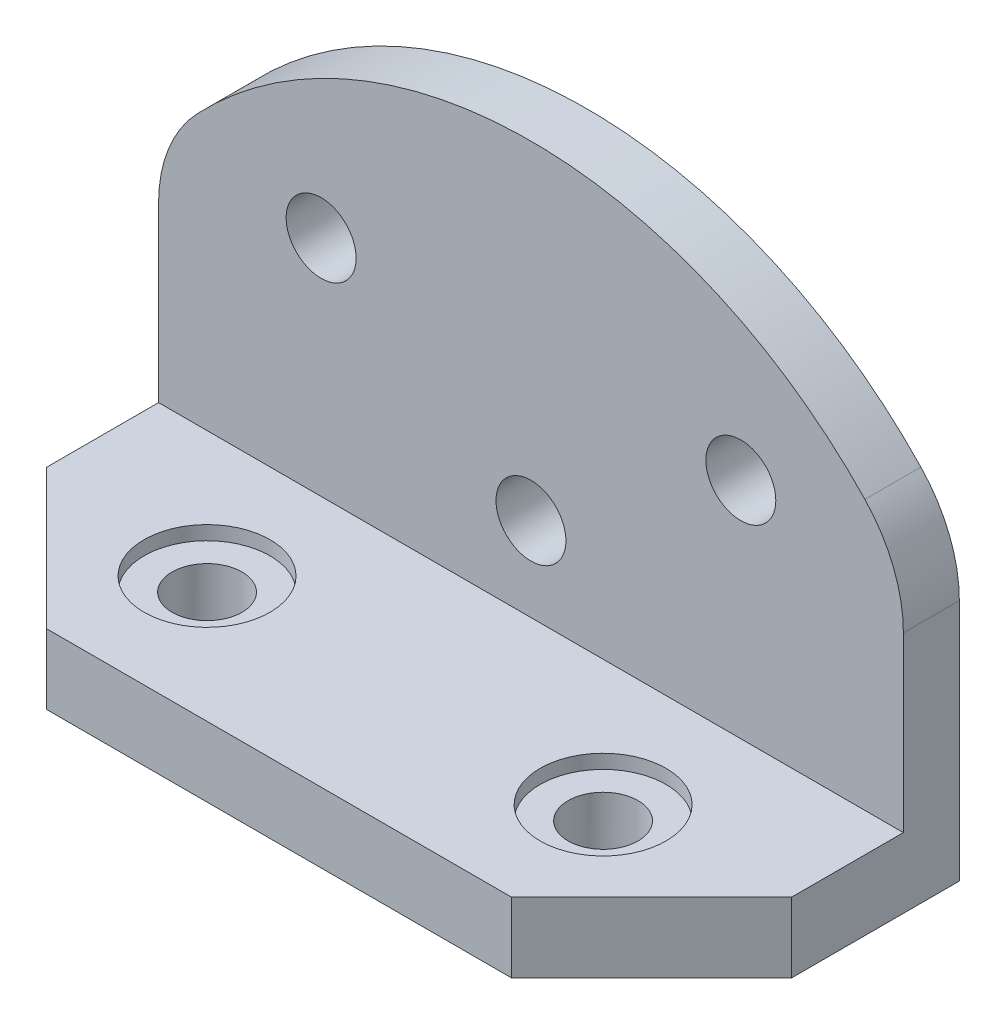
ISO-10303-21;
HEADER;
FILE_DESCRIPTION(('STEP AP214'),'2;1');
FILE_NAME('part.step','',(''),(''),'','','');
FILE_SCHEMA(('AUTOMOTIVE_DESIGN { 1 0 10303 214 1 1 1 1 }'));
ENDSEC;
DATA;
#1=APPLICATION_CONTEXT('core data for automotive mechanical design processes');
#2=APPLICATION_PROTOCOL_DEFINITION('international standard','automotive_design',2000,#1);
#3=PRODUCT_CONTEXT('',#1,'mechanical');
#4=PRODUCT('Part','Part','',(#3));
#5=PRODUCT_RELATED_PRODUCT_CATEGORY('part','',(#4));
#6=PRODUCT_DEFINITION_FORMATION('','',#4);
#7=PRODUCT_DEFINITION_CONTEXT('part definition',#1,'design');
#8=PRODUCT_DEFINITION('design','',#6,#7);
#9=PRODUCT_DEFINITION_SHAPE('','',#8);
#10=(LENGTH_UNIT() NAMED_UNIT(*) SI_UNIT(.MILLI.,.METRE.));
#11=(NAMED_UNIT(*) PLANE_ANGLE_UNIT() SI_UNIT($,.RADIAN.));
#12=(NAMED_UNIT(*) SI_UNIT($,.STERADIAN.) SOLID_ANGLE_UNIT());
#13=UNCERTAINTY_MEASURE_WITH_UNIT(LENGTH_MEASURE(1.E-05),#10,'distance_accuracy_value','');
#14=(GEOMETRIC_REPRESENTATION_CONTEXT(3) GLOBAL_UNCERTAINTY_ASSIGNED_CONTEXT((#13)) GLOBAL_UNIT_ASSIGNED_CONTEXT((#10,
#11,#12)) REPRESENTATION_CONTEXT('',''));
#15=CARTESIAN_POINT('',(0.,0.,0.));
#16=DIRECTION('',(0.,0.,1.));
#17=DIRECTION('',(1.,0.,0.));
#18=AXIS2_PLACEMENT_3D('',#15,#16,#17);
#19=CARTESIAN_POINT('',(7.0774048317708,-6.27479255491148,6.5));
#20=DIRECTION('',(0.,1.,0.));
#21=DIRECTION('',(0.,0.,1.));
#22=AXIS2_PLACEMENT_3D('',#19,#20,#21);
#23=CYLINDRICAL_SURFACE('',#22,1.25);
#24=CARTESIAN_POINT('',(7.0774048317708,0.225207445088519,6.5));
#25=DIRECTION('',(0.,1.,0.));
#26=DIRECTION('',(-1.,0.,0.));
#27=AXIS2_PLACEMENT_3D('',#24,#25,#26);
#28=CIRCLE('',#27,1.25);
#29=CARTESIAN_POINT('',(5.8274048317708,0.225207445088519,6.5));
#30=VERTEX_POINT('',#29);
#31=EDGE_CURVE('E140',#30,#30,#28,.T.);
#32=ORIENTED_EDGE('',*,*,#31,.F.);
#33=EDGE_LOOP('',(#32));
#34=FACE_BOUND('',#33,.T.);
#35=CARTESIAN_POINT('',(7.0774048317708,2.22520744508852,6.5));
#36=DIRECTION('',(0.,1.,0.));
#37=DIRECTION('',(0.,0.,1.));
#38=AXIS2_PLACEMENT_3D('',#35,#36,#37);
#39=CIRCLE('',#38,1.25);
#40=CARTESIAN_POINT('',(7.0774048317708,2.22520744508852,7.75));
#41=VERTEX_POINT('',#40);
#42=EDGE_CURVE('E452',#41,#41,#39,.F.);
#43=ORIENTED_EDGE('',*,*,#42,.F.);
#44=EDGE_LOOP('',(#43));
#45=FACE_BOUND('',#44,.T.);
#46=ADVANCED_FACE('F32',(#34,#45),#23,.F.);
#47=CARTESIAN_POINT('',(-7.0774048317708,-6.27479255491148,6.5));
#48=DIRECTION('',(0.,1.,0.));
#49=DIRECTION('',(0.,0.,1.));
#50=AXIS2_PLACEMENT_3D('',#47,#48,#49);
#51=CYLINDRICAL_SURFACE('',#50,1.25);
#52=CARTESIAN_POINT('',(-7.0774048317708,0.22520744508852,6.5));
#53=DIRECTION('',(0.,1.,0.));
#54=DIRECTION('',(-1.,0.,0.));
#55=AXIS2_PLACEMENT_3D('',#52,#53,#54);
#56=CIRCLE('',#55,1.25);
#57=CARTESIAN_POINT('',(-8.3274048317708,0.22520744508852,6.5));
#58=VERTEX_POINT('',#57);
#59=EDGE_CURVE('E135',#58,#58,#56,.T.);
#60=ORIENTED_EDGE('',*,*,#59,.F.);
#61=EDGE_LOOP('',(#60));
#62=FACE_BOUND('',#61,.T.);
#63=CARTESIAN_POINT('',(-7.0774048317708,2.22520744508852,6.5));
#64=DIRECTION('',(0.,1.,0.));
#65=DIRECTION('',(0.,0.,1.));
#66=AXIS2_PLACEMENT_3D('',#63,#64,#65);
#67=CIRCLE('',#66,1.25);
#68=CARTESIAN_POINT('',(-7.0774048317708,2.22520744508852,7.75));
#69=VERTEX_POINT('',#68);
#70=EDGE_CURVE('E458',#69,#69,#67,.F.);
#71=ORIENTED_EDGE('',*,*,#70,.F.);
#72=EDGE_LOOP('',(#71));
#73=FACE_BOUND('',#72,.T.);
#74=ADVANCED_FACE('F257',(#62,#73),#51,.F.);
#75=CARTESIAN_POINT('',(8.30973577148952,8.90739615578192,2.));
#76=DIRECTION('',(0.,0.,1.));
#77=DIRECTION('',(1.,0.,0.));
#78=AXIS2_PLACEMENT_3D('',#75,#76,#77);
#79=PLANE('',#78);
#80=DIRECTION('',(-1.,0.,0.));
#81=VECTOR('',#80,1.);
#82=CARTESIAN_POINT('',(-13.3097357714895,2.72520744508852,2.));
#83=LINE('',#82,#81);
#84=CARTESIAN_POINT('',(13.3097357714895,2.72520744508852,2.));
#85=VERTEX_POINT('',#84);
#86=CARTESIAN_POINT('',(-13.3097357714895,2.72520744508852,2.));
#87=VERTEX_POINT('',#86);
#88=EDGE_CURVE('E125',#85,#87,#83,.T.);
#89=ORIENTED_EDGE('',*,*,#88,.F.);
#90=DIRECTION('',(0.,1.,0.));
#91=VECTOR('',#90,1.);
#92=CARTESIAN_POINT('',(13.3097357714895,0.225207445088519,2.));
#93=LINE('',#92,#91);
#94=CARTESIAN_POINT('',(13.3097357714895,8.90739615578192,2.));
#95=VERTEX_POINT('',#94);
#96=EDGE_CURVE('E174',#85,#95,#93,.T.);
#97=ORIENTED_EDGE('',*,*,#96,.T.);
#98=CARTESIAN_POINT('',(8.30973577148952,8.90739615578192,2.));
#99=DIRECTION('',(0.,0.,1.));
#100=DIRECTION('',(1.,0.,0.));
#101=AXIS2_PLACEMENT_3D('',#98,#99,#100);
#102=CIRCLE('',#101,5.);
#103=CARTESIAN_POINT('',(11.9349756409376,12.3508879720875,2.));
#104=VERTEX_POINT('',#103);
#105=EDGE_CURVE('E172',#95,#104,#102,.T.);
#106=ORIENTED_EDGE('',*,*,#105,.T.);
#107=CARTESIAN_POINT('',(0.,1.01426131360597,2.));
#108=DIRECTION('',(0.,0.,1.));
#109=DIRECTION('',(1.,0.,0.));
#110=AXIS2_PLACEMENT_3D('',#107,#108,#109);
#111=CIRCLE('',#110,16.4609461314825);
#112=CARTESIAN_POINT('',(-11.9349756409376,12.3508879720875,2.));
#113=VERTEX_POINT('',#112);
#114=EDGE_CURVE('E206',#104,#113,#111,.T.);
#115=ORIENTED_EDGE('',*,*,#114,.T.);
#116=CARTESIAN_POINT('',(-8.30973577148952,8.90739615578192,2.));
#117=DIRECTION('',(0.,0.,1.));
#118=DIRECTION('',(1.,0.,0.));
#119=AXIS2_PLACEMENT_3D('',#116,#117,#118);
#120=CIRCLE('',#119,5.);
#121=CARTESIAN_POINT('',(-13.3097357714895,8.90739615578192,2.));
#122=VERTEX_POINT('',#121);
#123=EDGE_CURVE('E128',#113,#122,#120,.T.);
#124=ORIENTED_EDGE('',*,*,#123,.T.);
#125=DIRECTION('',(0.,-1.,0.));
#126=VECTOR('',#125,1.);
#127=CARTESIAN_POINT('',(-13.3097357714895,8.90739615578192,2.));
#128=LINE('',#127,#126);
#129=EDGE_CURVE('E113',#122,#87,#128,.T.);
#130=ORIENTED_EDGE('',*,*,#129,.T.);
#131=EDGE_LOOP('',(#89,#97,#106,#115,#124,#130));
#132=FACE_BOUND('',#131,.T.);
#133=CARTESIAN_POINT('',(-7.50026422851047,10.7252074450885,2.));
#134=DIRECTION('',(0.,0.,1.));
#135=DIRECTION('',(1.,0.,0.));
#136=AXIS2_PLACEMENT_3D('',#133,#134,#135);
#137=CIRCLE('',#136,1.25);
#138=CARTESIAN_POINT('',(-6.25026422851047,10.7252074450885,2.));
#139=VERTEX_POINT('',#138);
#140=EDGE_CURVE('E158',#139,#139,#137,.T.);
#141=ORIENTED_EDGE('',*,*,#140,.F.);
#142=EDGE_LOOP('',(#141));
#143=FACE_BOUND('',#142,.T.);
#144=CARTESIAN_POINT('',(7.49973577148953,10.7252074450885,2.));
#145=DIRECTION('',(0.,0.,1.));
#146=DIRECTION('',(1.,0.,0.));
#147=AXIS2_PLACEMENT_3D('',#144,#145,#146);
#148=CIRCLE('',#147,1.25);
#149=CARTESIAN_POINT('',(8.74973577148952,10.7252074450885,2.));
#150=VERTEX_POINT('',#149);
#151=EDGE_CURVE('E164',#150,#150,#148,.T.);
#152=ORIENTED_EDGE('',*,*,#151,.F.);
#153=EDGE_LOOP('',(#152));
#154=FACE_BOUND('',#153,.T.);
#155=CARTESIAN_POINT('',(-0.000264228510474251,5.72520744508852,2.));
#156=DIRECTION('',(0.,0.,1.));
#157=DIRECTION('',(1.,0.,0.));
#158=AXIS2_PLACEMENT_3D('',#155,#156,#157);
#159=CIRCLE('',#158,1.25);
#160=CARTESIAN_POINT('',(1.24973577148953,5.72520744508852,2.));
#161=VERTEX_POINT('',#160);
#162=EDGE_CURVE('E151',#161,#161,#159,.T.);
#163=ORIENTED_EDGE('',*,*,#162,.F.);
#164=EDGE_LOOP('',(#163));
#165=FACE_BOUND('',#164,.T.);
#166=ADVANCED_FACE('F123',(#132,#143,#154,#165),#79,.T.);
#167=CARTESIAN_POINT('',(8.30973577148952,8.90739615578192,0.));
#168=DIRECTION('',(0.,0.,1.));
#169=DIRECTION('',(1.,0.,0.));
#170=AXIS2_PLACEMENT_3D('',#167,#168,#169);
#171=PLANE('',#170);
#172=DIRECTION('',(0.,1.,0.));
#173=VECTOR('',#172,1.);
#174=CARTESIAN_POINT('',(13.3097357714895,0.225207445088519,0.));
#175=LINE('',#174,#173);
#176=CARTESIAN_POINT('',(13.3097357714895,0.225207445088519,0.));
#177=VERTEX_POINT('',#176);
#178=CARTESIAN_POINT('',(13.3097357714895,8.90739615578192,0.));
#179=VERTEX_POINT('',#178);
#180=EDGE_CURVE('E167',#177,#179,#175,.T.);
#181=ORIENTED_EDGE('',*,*,#180,.F.);
#182=DIRECTION('',(1.,0.,0.));
#183=VECTOR('',#182,1.);
#184=CARTESIAN_POINT('',(-13.3097357714895,0.22520744508852,0.));
#185=LINE('',#184,#183);
#186=CARTESIAN_POINT('',(-13.3097357714895,0.22520744508852,0.));
#187=VERTEX_POINT('',#186);
#188=EDGE_CURVE('E176',#187,#177,#185,.T.);
#189=ORIENTED_EDGE('',*,*,#188,.F.);
#190=DIRECTION('',(0.,-1.,0.));
#191=VECTOR('',#190,1.);
#192=CARTESIAN_POINT('',(-13.3097357714895,8.90739615578192,0.));
#193=LINE('',#192,#191);
#194=CARTESIAN_POINT('',(-13.3097357714895,8.90739615578192,0.));
#195=VERTEX_POINT('',#194);
#196=EDGE_CURVE('E194',#195,#187,#193,.T.);
#197=ORIENTED_EDGE('',*,*,#196,.F.);
#198=CARTESIAN_POINT('',(-8.30973577148952,8.90739615578192,0.));
#199=DIRECTION('',(0.,0.,1.));
#200=DIRECTION('',(1.,0.,0.));
#201=AXIS2_PLACEMENT_3D('',#198,#199,#200);
#202=CIRCLE('',#201,5.);
#203=CARTESIAN_POINT('',(-11.9349756409376,12.3508879720875,0.));
#204=VERTEX_POINT('',#203);
#205=EDGE_CURVE('E197',#204,#195,#202,.T.);
#206=ORIENTED_EDGE('',*,*,#205,.F.);
#207=CARTESIAN_POINT('',(0.,1.01426131360597,0.));
#208=DIRECTION('',(0.,0.,1.));
#209=DIRECTION('',(1.,0.,0.));
#210=AXIS2_PLACEMENT_3D('',#207,#208,#209);
#211=CIRCLE('',#210,16.4609461314825);
#212=CARTESIAN_POINT('',(11.9349756409376,12.3508879720875,0.));
#213=VERTEX_POINT('',#212);
#214=EDGE_CURVE('E199',#213,#204,#211,.T.);
#215=ORIENTED_EDGE('',*,*,#214,.F.);
#216=CARTESIAN_POINT('',(8.30973577148952,8.90739615578192,0.));
#217=DIRECTION('',(0.,0.,1.));
#218=DIRECTION('',(1.,0.,0.));
#219=AXIS2_PLACEMENT_3D('',#216,#217,#218);
#220=CIRCLE('',#219,5.);
#221=EDGE_CURVE('E201',#179,#213,#220,.T.);
#222=ORIENTED_EDGE('',*,*,#221,.F.);
#223=EDGE_LOOP('',(#181,#189,#197,#206,#215,#222));
#224=FACE_BOUND('',#223,.T.);
#225=CARTESIAN_POINT('',(7.49973577148953,10.7252074450885,0.));
#226=DIRECTION('',(0.,0.,1.));
#227=DIRECTION('',(1.,0.,0.));
#228=AXIS2_PLACEMENT_3D('',#225,#226,#227);
#229=CIRCLE('',#228,1.25);
#230=CARTESIAN_POINT('',(8.74973577148952,10.7252074450885,0.));
#231=VERTEX_POINT('',#230);
#232=EDGE_CURVE('E161',#231,#231,#229,.T.);
#233=ORIENTED_EDGE('',*,*,#232,.T.);
#234=EDGE_LOOP('',(#233));
#235=FACE_BOUND('',#234,.T.);
#236=CARTESIAN_POINT('',(-7.50026422851047,10.7252074450885,0.));
#237=DIRECTION('',(0.,0.,1.));
#238=DIRECTION('',(1.,0.,0.));
#239=AXIS2_PLACEMENT_3D('',#236,#237,#238);
#240=CIRCLE('',#239,1.25);
#241=CARTESIAN_POINT('',(-6.25026422851047,10.7252074450885,0.));
#242=VERTEX_POINT('',#241);
#243=EDGE_CURVE('E154',#242,#242,#240,.T.);
#244=ORIENTED_EDGE('',*,*,#243,.T.);
#245=EDGE_LOOP('',(#244));
#246=FACE_BOUND('',#245,.T.);
#247=CARTESIAN_POINT('',(-0.000264228510474251,5.72520744508852,0.));
#248=DIRECTION('',(0.,0.,1.));
#249=DIRECTION('',(1.,0.,0.));
#250=AXIS2_PLACEMENT_3D('',#247,#248,#249);
#251=CIRCLE('',#250,1.25);
#252=CARTESIAN_POINT('',(1.24973577148953,5.72520744508852,0.));
#253=VERTEX_POINT('',#252);
#254=EDGE_CURVE('E155',#253,#253,#251,.T.);
#255=ORIENTED_EDGE('',*,*,#254,.T.);
#256=EDGE_LOOP('',(#255));
#257=FACE_BOUND('',#256,.T.);
#258=ADVANCED_FACE('F224',(#224,#235,#246,#257),#171,.F.);
#259=CARTESIAN_POINT('',(13.3097357714895,0.225207445088519,2.));
#260=DIRECTION('',(-1.,0.,0.));
#261=DIRECTION('',(0.,0.,1.));
#262=AXIS2_PLACEMENT_3D('',#259,#260,#261);
#263=PLANE('',#262);
#264=DIRECTION('',(0.,0.,-1.));
#265=VECTOR('',#264,1.);
#266=CARTESIAN_POINT('',(13.3097357714895,2.72520744508852,11.));
#267=LINE('',#266,#265);
#268=CARTESIAN_POINT('',(13.3097357714895,2.72520744508852,5.99999999999998));
#269=VERTEX_POINT('',#268);
#270=EDGE_CURVE('E118',#269,#85,#267,.T.);
#271=ORIENTED_EDGE('',*,*,#270,.F.);
#272=DIRECTION('',(0.,-1.,0.));
#273=VECTOR('',#272,1.);
#274=CARTESIAN_POINT('',(13.3097357714895,0.225207445088519,5.99999999999998));
#275=LINE('',#274,#273);
#276=CARTESIAN_POINT('',(13.3097357714895,0.225207445088519,5.99999999999998));
#277=VERTEX_POINT('',#276);
#278=EDGE_CURVE('E55',#269,#277,#275,.T.);
#279=ORIENTED_EDGE('',*,*,#278,.T.);
#280=DIRECTION('',(0.,0.,-1.));
#281=VECTOR('',#280,1.);
#282=CARTESIAN_POINT('',(13.3097357714895,0.225207445088519,2.));
#283=LINE('',#282,#281);
#284=EDGE_CURVE('E130',#277,#177,#283,.T.);
#285=ORIENTED_EDGE('',*,*,#284,.T.);
#286=ORIENTED_EDGE('',*,*,#180,.T.);
#287=DIRECTION('',(0.,0.,-1.));
#288=VECTOR('',#287,1.);
#289=CARTESIAN_POINT('',(13.3097357714895,8.90739615578192,2.));
#290=LINE('',#289,#288);
#291=EDGE_CURVE('E177',#95,#179,#290,.T.);
#292=ORIENTED_EDGE('',*,*,#291,.F.);
#293=ORIENTED_EDGE('',*,*,#96,.F.);
#294=EDGE_LOOP('',(#271,#279,#285,#286,#292,#293));
#295=FACE_BOUND('',#294,.T.);
#296=ADVANCED_FACE('F247',(#295),#263,.F.);
#297=CARTESIAN_POINT('',(8.30973577148952,8.90739615578192,2.));
#298=DIRECTION('',(0.,0.,-1.));
#299=DIRECTION('',(-1.,0.,0.));
#300=AXIS2_PLACEMENT_3D('',#297,#298,#299);
#301=CYLINDRICAL_SURFACE('',#300,5.);
#302=ORIENTED_EDGE('',*,*,#221,.T.);
#303=DIRECTION('',(0.,0.,-1.));
#304=VECTOR('',#303,1.);
#305=CARTESIAN_POINT('',(11.9349756409376,12.3508879720875,2.));
#306=LINE('',#305,#304);
#307=EDGE_CURVE('E181',#104,#213,#306,.T.);
#308=ORIENTED_EDGE('',*,*,#307,.F.);
#309=ORIENTED_EDGE('',*,*,#105,.F.);
#310=ORIENTED_EDGE('',*,*,#291,.T.);
#311=EDGE_LOOP('',(#302,#308,#309,#310));
#312=FACE_BOUND('',#311,.T.);
#313=ADVANCED_FACE('F213',(#312),#301,.T.);
#314=CARTESIAN_POINT('',(0.,1.01426131360597,2.));
#315=DIRECTION('',(0.,0.,-1.));
#316=DIRECTION('',(-1.,0.,0.));
#317=AXIS2_PLACEMENT_3D('',#314,#315,#316);
#318=CYLINDRICAL_SURFACE('',#317,16.4609461314825);
#319=ORIENTED_EDGE('',*,*,#214,.T.);
#320=DIRECTION('',(0.,0.,-1.));
#321=VECTOR('',#320,1.);
#322=CARTESIAN_POINT('',(-11.9349756409376,12.3508879720875,2.));
#323=LINE('',#322,#321);
#324=EDGE_CURVE('E184',#113,#204,#323,.T.);
#325=ORIENTED_EDGE('',*,*,#324,.F.);
#326=ORIENTED_EDGE('',*,*,#114,.F.);
#327=ORIENTED_EDGE('',*,*,#307,.T.);
#328=EDGE_LOOP('',(#319,#325,#326,#327));
#329=FACE_BOUND('',#328,.T.);
#330=ADVANCED_FACE('F216',(#329),#318,.T.);
#331=CARTESIAN_POINT('',(-8.30973577148952,8.90739615578192,2.));
#332=DIRECTION('',(0.,0.,-1.));
#333=DIRECTION('',(-1.,0.,0.));
#334=AXIS2_PLACEMENT_3D('',#331,#332,#333);
#335=CYLINDRICAL_SURFACE('',#334,5.);
#336=ORIENTED_EDGE('',*,*,#205,.T.);
#337=DIRECTION('',(0.,0.,-1.));
#338=VECTOR('',#337,1.);
#339=CARTESIAN_POINT('',(-13.3097357714895,8.90739615578192,2.));
#340=LINE('',#339,#338);
#341=EDGE_CURVE('E187',#122,#195,#340,.T.);
#342=ORIENTED_EDGE('',*,*,#341,.F.);
#343=ORIENTED_EDGE('',*,*,#123,.F.);
#344=ORIENTED_EDGE('',*,*,#324,.T.);
#345=EDGE_LOOP('',(#336,#342,#343,#344));
#346=FACE_BOUND('',#345,.T.);
#347=ADVANCED_FACE('F219',(#346),#335,.T.);
#348=CARTESIAN_POINT('',(-13.3097357714895,8.90739615578192,2.));
#349=DIRECTION('',(1.,0.,0.));
#350=DIRECTION('',(0.,0.,-1.));
#351=AXIS2_PLACEMENT_3D('',#348,#349,#350);
#352=PLANE('',#351);
#353=DIRECTION('',(0.,0.,-1.));
#354=VECTOR('',#353,1.);
#355=CARTESIAN_POINT('',(-13.3097357714895,0.22520744508852,2.));
#356=LINE('',#355,#354);
#357=CARTESIAN_POINT('',(-13.3097357714895,0.22520744508852,5.99999999999998));
#358=VERTEX_POINT('',#357);
#359=EDGE_CURVE('E189',#358,#187,#356,.T.);
#360=ORIENTED_EDGE('',*,*,#359,.F.);
#361=DIRECTION('',(0.,1.,0.));
#362=VECTOR('',#361,1.);
#363=CARTESIAN_POINT('',(-13.3097357714895,8.90739615578192,5.99999999999998));
#364=LINE('',#363,#362);
#365=CARTESIAN_POINT('',(-13.3097357714895,2.72520744508852,5.99999999999998));
#366=VERTEX_POINT('',#365);
#367=EDGE_CURVE('E11',#358,#366,#364,.T.);
#368=ORIENTED_EDGE('',*,*,#367,.T.);
#369=DIRECTION('',(0.,0.,-1.));
#370=VECTOR('',#369,1.);
#371=CARTESIAN_POINT('',(-13.3097357714895,2.72520744508852,11.));
#372=LINE('',#371,#370);
#373=EDGE_CURVE('E109',#366,#87,#372,.T.);
#374=ORIENTED_EDGE('',*,*,#373,.T.);
#375=ORIENTED_EDGE('',*,*,#129,.F.);
#376=ORIENTED_EDGE('',*,*,#341,.T.);
#377=ORIENTED_EDGE('',*,*,#196,.T.);
#378=EDGE_LOOP('',(#360,#368,#374,#375,#376,#377));
#379=FACE_BOUND('',#378,.T.);
#380=ADVANCED_FACE('F111',(#379),#352,.F.);
#381=CARTESIAN_POINT('',(-13.3097357714895,0.22520744508852,2.));
#382=DIRECTION('',(0.,1.,0.));
#383=DIRECTION('',(-1.,0.,0.));
#384=AXIS2_PLACEMENT_3D('',#381,#382,#383);
#385=PLANE('',#384);
#386=ORIENTED_EDGE('',*,*,#31,.T.);
#387=EDGE_LOOP('',(#386));
#388=FACE_BOUND('',#387,.T.);
#389=ORIENTED_EDGE('',*,*,#59,.T.);
#390=EDGE_LOOP('',(#389));
#391=FACE_BOUND('',#390,.T.);
#392=ORIENTED_EDGE('',*,*,#284,.F.);
#393=DIRECTION('',(0.707106781186546,0.,-0.707106781186549));
#394=VECTOR('',#393,1.);
#395=CARTESIAN_POINT('',(8.30973577148952,0.225207445088519,11.));
#396=LINE('',#395,#394);
#397=CARTESIAN_POINT('',(8.30973577148952,0.225207445088519,11.));
#398=VERTEX_POINT('',#397);
#399=EDGE_CURVE('E40',#277,#398,#396,.F.);
#400=ORIENTED_EDGE('',*,*,#399,.T.);
#401=DIRECTION('',(1.,0.,0.));
#402=VECTOR('',#401,1.);
#403=CARTESIAN_POINT('',(-13.3097357714895,0.22520744508852,11.));
#404=LINE('',#403,#402);
#405=CARTESIAN_POINT('',(-8.30973577148953,0.22520744508852,11.));
#406=VERTEX_POINT('',#405);
#407=EDGE_CURVE('E134',#406,#398,#404,.T.);
#408=ORIENTED_EDGE('',*,*,#407,.F.);
#409=DIRECTION('',(0.707106781186546,0.,0.707106781186549));
#410=VECTOR('',#409,1.);
#411=CARTESIAN_POINT('',(-8.30973577148952,0.22520744508852,11.));
#412=LINE('',#411,#410);
#413=EDGE_CURVE('E47',#406,#358,#412,.F.);
#414=ORIENTED_EDGE('',*,*,#413,.T.);
#415=ORIENTED_EDGE('',*,*,#359,.T.);
#416=ORIENTED_EDGE('',*,*,#188,.T.);
#417=EDGE_LOOP('',(#392,#400,#408,#414,#415,#416));
#418=FACE_BOUND('',#417,.T.);
#419=ADVANCED_FACE('F226',(#388,#391,#418),#385,.F.);
#420=CARTESIAN_POINT('',(7.49973577148953,10.7252074450885,2.));
#421=DIRECTION('',(0.,0.,-1.));
#422=DIRECTION('',(-1.,0.,0.));
#423=AXIS2_PLACEMENT_3D('',#420,#421,#422);
#424=CYLINDRICAL_SURFACE('',#423,1.25);
#425=ORIENTED_EDGE('',*,*,#151,.T.);
#426=EDGE_LOOP('',(#425));
#427=FACE_BOUND('',#426,.T.);
#428=ORIENTED_EDGE('',*,*,#232,.F.);
#429=EDGE_LOOP('',(#428));
#430=FACE_BOUND('',#429,.T.);
#431=ADVANCED_FACE('F284',(#427,#430),#424,.F.);
#432=CARTESIAN_POINT('',(-7.50026422851047,10.7252074450885,2.));
#433=DIRECTION('',(0.,0.,-1.));
#434=DIRECTION('',(-1.,0.,0.));
#435=AXIS2_PLACEMENT_3D('',#432,#433,#434);
#436=CYLINDRICAL_SURFACE('',#435,1.25);
#437=ORIENTED_EDGE('',*,*,#140,.T.);
#438=EDGE_LOOP('',(#437));
#439=FACE_BOUND('',#438,.T.);
#440=ORIENTED_EDGE('',*,*,#243,.F.);
#441=EDGE_LOOP('',(#440));
#442=FACE_BOUND('',#441,.T.);
#443=ADVANCED_FACE('F280',(#439,#442),#436,.F.);
#444=CARTESIAN_POINT('',(-0.000264228510474251,5.72520744508852,2.));
#445=DIRECTION('',(0.,0.,-1.));
#446=DIRECTION('',(-1.,0.,0.));
#447=AXIS2_PLACEMENT_3D('',#444,#445,#446);
#448=CYLINDRICAL_SURFACE('',#447,1.25);
#449=ORIENTED_EDGE('',*,*,#162,.T.);
#450=EDGE_LOOP('',(#449));
#451=FACE_BOUND('',#450,.T.);
#452=ORIENTED_EDGE('',*,*,#254,.F.);
#453=EDGE_LOOP('',(#452));
#454=FACE_BOUND('',#453,.T.);
#455=ADVANCED_FACE('F276',(#451,#454),#448,.F.);
#456=CARTESIAN_POINT('',(-13.3097357714895,2.72520744508852,11.));
#457=DIRECTION('',(0.,-1.,0.));
#458=DIRECTION('',(0.,0.,-1.));
#459=AXIS2_PLACEMENT_3D('',#456,#457,#458);
#460=PLANE('',#459);
#461=CARTESIAN_POINT('',(7.0774048317708,2.72520744508852,6.5));
#462=DIRECTION('',(0.,1.,0.));
#463=DIRECTION('',(0.,0.,1.));
#464=AXIS2_PLACEMENT_3D('',#461,#462,#463);
#465=CIRCLE('',#464,2.25);
#466=CARTESIAN_POINT('',(7.0774048317708,2.72520744508852,8.75));
#467=VERTEX_POINT('',#466);
#468=EDGE_CURVE('E450',#467,#467,#465,.T.);
#469=ORIENTED_EDGE('',*,*,#468,.F.);
#470=EDGE_LOOP('',(#469));
#471=FACE_BOUND('',#470,.T.);
#472=CARTESIAN_POINT('',(-7.0774048317708,2.72520744508852,6.5));
#473=DIRECTION('',(0.,1.,0.));
#474=DIRECTION('',(0.,0.,1.));
#475=AXIS2_PLACEMENT_3D('',#472,#473,#474);
#476=CIRCLE('',#475,2.25);
#477=CARTESIAN_POINT('',(-7.0774048317708,2.72520744508852,8.75));
#478=VERTEX_POINT('',#477);
#479=EDGE_CURVE('E459',#478,#478,#476,.T.);
#480=ORIENTED_EDGE('',*,*,#479,.F.);
#481=EDGE_LOOP('',(#480));
#482=FACE_BOUND('',#481,.T.);
#483=DIRECTION('',(-1.,0.,0.));
#484=VECTOR('',#483,1.);
#485=CARTESIAN_POINT('',(-13.3097357714895,2.72520744508852,11.));
#486=LINE('',#485,#484);
#487=CARTESIAN_POINT('',(8.30973577148952,2.72520744508852,11.));
#488=VERTEX_POINT('',#487);
#489=CARTESIAN_POINT('',(-8.30973577148953,2.72520744508852,11.));
#490=VERTEX_POINT('',#489);
#491=EDGE_CURVE('E119',#488,#490,#486,.T.);
#492=ORIENTED_EDGE('',*,*,#491,.F.);
#493=DIRECTION('',(-0.707106781186546,0.,0.707106781186549));
#494=VECTOR('',#493,1.);
#495=CARTESIAN_POINT('',(8.30973577148952,2.72520744508852,11.));
#496=LINE('',#495,#494);
#497=EDGE_CURVE('E233',#488,#269,#496,.F.);
#498=ORIENTED_EDGE('',*,*,#497,.T.);
#499=ORIENTED_EDGE('',*,*,#270,.T.);
#500=ORIENTED_EDGE('',*,*,#88,.T.);
#501=ORIENTED_EDGE('',*,*,#373,.F.);
#502=DIRECTION('',(-0.707106781186546,0.,-0.707106781186549));
#503=VECTOR('',#502,1.);
#504=CARTESIAN_POINT('',(-8.30973577148952,2.72520744508852,11.));
#505=LINE('',#504,#503);
#506=EDGE_CURVE('E231',#366,#490,#505,.F.);
#507=ORIENTED_EDGE('',*,*,#506,.T.);
#508=EDGE_LOOP('',(#492,#498,#499,#500,#501,#507));
#509=FACE_BOUND('',#508,.T.);
#510=ADVANCED_FACE('F133',(#471,#482,#509),#460,.F.);
#511=CARTESIAN_POINT('',(0.,0.,11.));
#512=DIRECTION('',(0.,0.,-1.));
#513=DIRECTION('',(-1.,0.,0.));
#514=AXIS2_PLACEMENT_3D('',#511,#512,#513);
#515=PLANE('',#514);
#516=ORIENTED_EDGE('',*,*,#407,.T.);
#517=DIRECTION('',(0.,1.,0.));
#518=VECTOR('',#517,1.);
#519=CARTESIAN_POINT('',(8.30973577148952,0.,11.));
#520=LINE('',#519,#518);
#521=EDGE_CURVE('E234',#398,#488,#520,.T.);
#522=ORIENTED_EDGE('',*,*,#521,.T.);
#523=ORIENTED_EDGE('',*,*,#491,.T.);
#524=DIRECTION('',(0.,-1.,0.));
#525=VECTOR('',#524,1.);
#526=CARTESIAN_POINT('',(-8.30973577148952,0.,11.));
#527=LINE('',#526,#525);
#528=EDGE_CURVE('E180',#490,#406,#527,.T.);
#529=ORIENTED_EDGE('',*,*,#528,.T.);
#530=EDGE_LOOP('',(#516,#522,#523,#529));
#531=FACE_BOUND('',#530,.T.);
#532=ADVANCED_FACE('F245',(#531),#515,.F.);
#533=CARTESIAN_POINT('',(-7.0774048317708,2.22520744508852,6.5));
#534=DIRECTION('',(0.,1.,0.));
#535=DIRECTION('',(0.,0.,1.));
#536=AXIS2_PLACEMENT_3D('',#533,#534,#535);
#537=PLANE('',#536);
#538=CARTESIAN_POINT('',(-7.0774048317708,2.22520744508852,6.5));
#539=DIRECTION('',(0.,1.,0.));
#540=DIRECTION('',(0.,0.,1.));
#541=AXIS2_PLACEMENT_3D('',#538,#539,#540);
#542=CIRCLE('',#541,2.25);
#543=CARTESIAN_POINT('',(-7.0774048317708,2.22520744508852,8.75));
#544=VERTEX_POINT('',#543);
#545=EDGE_CURVE('E455',#544,#544,#542,.T.);
#546=ORIENTED_EDGE('',*,*,#545,.T.);
#547=EDGE_LOOP('',(#546));
#548=FACE_BOUND('',#547,.T.);
#549=ORIENTED_EDGE('',*,*,#70,.T.);
#550=EDGE_LOOP('',(#549));
#551=FACE_BOUND('',#550,.T.);
#552=ADVANCED_FACE('F273',(#548,#551),#537,.T.);
#553=CARTESIAN_POINT('',(-7.0774048317708,2.22520744508852,6.5));
#554=DIRECTION('',(0.,1.,0.));
#555=DIRECTION('',(0.,0.,1.));
#556=AXIS2_PLACEMENT_3D('',#553,#554,#555);
#557=CYLINDRICAL_SURFACE('',#556,2.25);
#558=ORIENTED_EDGE('',*,*,#545,.F.);
#559=EDGE_LOOP('',(#558));
#560=FACE_BOUND('',#559,.T.);
#561=ORIENTED_EDGE('',*,*,#479,.T.);
#562=EDGE_LOOP('',(#561));
#563=FACE_BOUND('',#562,.T.);
#564=ADVANCED_FACE('F268',(#560,#563),#557,.F.);
#565=CARTESIAN_POINT('',(7.0774048317708,2.22520744508852,6.5));
#566=DIRECTION('',(0.,1.,0.));
#567=DIRECTION('',(0.,0.,1.));
#568=AXIS2_PLACEMENT_3D('',#565,#566,#567);
#569=PLANE('',#568);
#570=CARTESIAN_POINT('',(7.0774048317708,2.22520744508852,6.5));
#571=DIRECTION('',(0.,1.,0.));
#572=DIRECTION('',(0.,0.,1.));
#573=AXIS2_PLACEMENT_3D('',#570,#571,#572);
#574=CIRCLE('',#573,2.25);
#575=CARTESIAN_POINT('',(7.0774048317708,2.22520744508852,8.75));
#576=VERTEX_POINT('',#575);
#577=EDGE_CURVE('E447',#576,#576,#574,.T.);
#578=ORIENTED_EDGE('',*,*,#577,.T.);
#579=EDGE_LOOP('',(#578));
#580=FACE_BOUND('',#579,.T.);
#581=ORIENTED_EDGE('',*,*,#42,.T.);
#582=EDGE_LOOP('',(#581));
#583=FACE_BOUND('',#582,.T.);
#584=ADVANCED_FACE('F350',(#580,#583),#569,.T.);
#585=CARTESIAN_POINT('',(7.0774048317708,2.22520744508852,6.5));
#586=DIRECTION('',(0.,1.,0.));
#587=DIRECTION('',(0.,0.,1.));
#588=AXIS2_PLACEMENT_3D('',#585,#586,#587);
#589=CYLINDRICAL_SURFACE('',#588,2.25);
#590=ORIENTED_EDGE('',*,*,#577,.F.);
#591=EDGE_LOOP('',(#590));
#592=FACE_BOUND('',#591,.T.);
#593=ORIENTED_EDGE('',*,*,#468,.T.);
#594=EDGE_LOOP('',(#593));
#595=FACE_BOUND('',#594,.T.);
#596=ADVANCED_FACE('F357',(#592,#595),#589,.F.);
#597=CARTESIAN_POINT('',(8.30973577148952,0.,11.));
#598=DIRECTION('',(-0.707106781186549,0.,-0.707106781186546));
#599=DIRECTION('',(0.,1.,0.));
#600=AXIS2_PLACEMENT_3D('',#597,#598,#599);
#601=PLANE('',#600);
#602=ORIENTED_EDGE('',*,*,#399,.F.);
#603=ORIENTED_EDGE('',*,*,#278,.F.);
#604=ORIENTED_EDGE('',*,*,#497,.F.);
#605=ORIENTED_EDGE('',*,*,#521,.F.);
#606=EDGE_LOOP('',(#602,#603,#604,#605));
#607=FACE_BOUND('',#606,.T.);
#608=ADVANCED_FACE('F246',(#607),#601,.F.);
#609=CARTESIAN_POINT('',(-8.30973577148952,0.,11.));
#610=DIRECTION('',(0.707106781186549,0.,-0.707106781186546));
#611=DIRECTION('',(0.,-1.,0.));
#612=AXIS2_PLACEMENT_3D('',#609,#610,#611);
#613=PLANE('',#612);
#614=ORIENTED_EDGE('',*,*,#506,.F.);
#615=ORIENTED_EDGE('',*,*,#367,.F.);
#616=ORIENTED_EDGE('',*,*,#413,.F.);
#617=ORIENTED_EDGE('',*,*,#528,.F.);
#618=EDGE_LOOP('',(#614,#615,#616,#617));
#619=FACE_BOUND('',#618,.T.);
#620=ADVANCED_FACE('F34',(#619),#613,.F.);
#621=CLOSED_SHELL('',(#46,#74,#166,#258,#296,#313,#330,#347,#380,#419,#431,#443,#455,#510,#532,
#552,#564,#584,#596,#608,#620));
#622=MANIFOLD_SOLID_BREP('B2',#621);
#623=ADVANCED_BREP_SHAPE_REPRESENTATION('',(#18,#622),#14);
#624=SHAPE_DEFINITION_REPRESENTATION(#9,#623);
ENDSEC;
END-ISO-10303-21;
